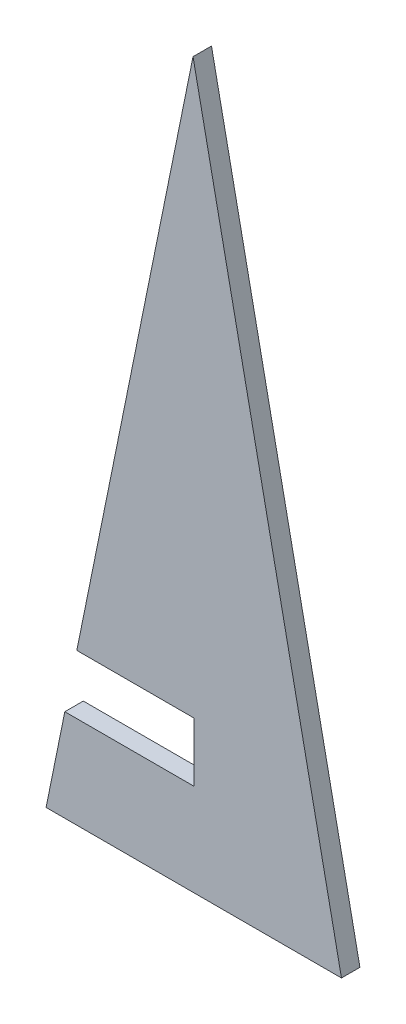
ISO-10303-21;
HEADER;
FILE_DESCRIPTION(('STEP AP214'),'2;1');
FILE_NAME('part.step','',(''),(''),'','','');
FILE_SCHEMA(('AUTOMOTIVE_DESIGN { 1 0 10303 214 1 1 1 1 }'));
ENDSEC;
DATA;
#1=APPLICATION_CONTEXT('core data for automotive mechanical design processes');
#2=APPLICATION_PROTOCOL_DEFINITION('international standard','automotive_design',2000,#1);
#3=PRODUCT_CONTEXT('',#1,'mechanical');
#4=PRODUCT('Part','Part','',(#3));
#5=PRODUCT_RELATED_PRODUCT_CATEGORY('part','',(#4));
#6=PRODUCT_DEFINITION_FORMATION('','',#4);
#7=PRODUCT_DEFINITION_CONTEXT('part definition',#1,'design');
#8=PRODUCT_DEFINITION('design','',#6,#7);
#9=PRODUCT_DEFINITION_SHAPE('','',#8);
#10=(LENGTH_UNIT() NAMED_UNIT(*) SI_UNIT(.MILLI.,.METRE.));
#11=(NAMED_UNIT(*) PLANE_ANGLE_UNIT() SI_UNIT($,.RADIAN.));
#12=(NAMED_UNIT(*) SI_UNIT($,.STERADIAN.) SOLID_ANGLE_UNIT());
#13=UNCERTAINTY_MEASURE_WITH_UNIT(LENGTH_MEASURE(1.E-05),#10,'distance_accuracy_value','');
#14=(GEOMETRIC_REPRESENTATION_CONTEXT(3) GLOBAL_UNCERTAINTY_ASSIGNED_CONTEXT((#13)) GLOBAL_UNIT_ASSIGNED_CONTEXT((#10,
#11,#12)) REPRESENTATION_CONTEXT('',''));
#15=CARTESIAN_POINT('',(0.,0.,0.));
#16=DIRECTION('',(0.,0.,1.));
#17=DIRECTION('',(1.,0.,0.));
#18=AXIS2_PLACEMENT_3D('',#15,#16,#17);
#19=CARTESIAN_POINT('',(0.,0.,-10.));
#20=DIRECTION('',(-0.98,0.198997487421324,0.));
#21=DIRECTION('',(-0.198997487421324,-0.98,0.));
#22=AXIS2_PLACEMENT_3D('',#19,#20,#21);
#23=PLANE('',#22);
#24=DIRECTION('',(0.,0.,-1.));
#25=VECTOR('',#24,1.);
#26=CARTESIAN_POINT('',(10.1529330317002,50.,0.));
#27=LINE('',#26,#25);
#28=CARTESIAN_POINT('',(10.1529330317002,50.,0.));
#29=VERTEX_POINT('',#28);
#30=CARTESIAN_POINT('',(10.1529330317002,50.,-10.));
#31=VERTEX_POINT('',#30);
#32=EDGE_CURVE('E144',#29,#31,#27,.T.);
#33=ORIENTED_EDGE('',*,*,#32,.T.);
#34=DIRECTION('',(-0.198997487421324,-0.98,0.));
#35=VECTOR('',#34,1.);
#36=CARTESIAN_POINT('',(0.,0.,-10.));
#37=LINE('',#36,#35);
#38=CARTESIAN_POINT('',(0.,0.,-10.));
#39=VERTEX_POINT('',#38);
#40=EDGE_CURVE('E65',#31,#39,#37,.T.);
#41=ORIENTED_EDGE('',*,*,#40,.T.);
#42=DIRECTION('',(0.,0.,1.));
#43=VECTOR('',#42,1.);
#44=CARTESIAN_POINT('',(0.,0.,-10.));
#45=LINE('',#44,#43);
#46=CARTESIAN_POINT('',(0.,0.,0.));
#47=VERTEX_POINT('',#46);
#48=EDGE_CURVE('E11',#39,#47,#45,.T.);
#49=ORIENTED_EDGE('',*,*,#48,.T.);
#50=DIRECTION('',(-0.198997487421324,-0.98,0.));
#51=VECTOR('',#50,1.);
#52=CARTESIAN_POINT('',(0.,0.,0.));
#53=LINE('',#52,#51);
#54=EDGE_CURVE('E84',#29,#47,#53,.T.);
#55=ORIENTED_EDGE('',*,*,#54,.F.);
#56=EDGE_LOOP('',(#33,#41,#49,#55));
#57=FACE_BOUND('',#56,.T.);
#58=ADVANCED_FACE('F40',(#57),#23,.T.);
#59=CARTESIAN_POINT('',(160.,0.,-10.));
#60=DIRECTION('',(0.,-1.,0.));
#61=DIRECTION('',(1.,0.,0.));
#62=AXIS2_PLACEMENT_3D('',#59,#60,#61);
#63=PLANE('',#62);
#64=DIRECTION('',(1.,0.,0.));
#65=VECTOR('',#64,1.);
#66=CARTESIAN_POINT('',(160.,0.,0.));
#67=LINE('',#66,#65);
#68=CARTESIAN_POINT('',(160.,0.,0.));
#69=VERTEX_POINT('',#68);
#70=EDGE_CURVE('E143',#47,#69,#67,.T.);
#71=ORIENTED_EDGE('',*,*,#70,.F.);
#72=ORIENTED_EDGE('',*,*,#48,.F.);
#73=DIRECTION('',(1.,0.,0.));
#74=VECTOR('',#73,1.);
#75=CARTESIAN_POINT('',(160.,0.,-10.));
#76=LINE('',#75,#74);
#77=CARTESIAN_POINT('',(160.,0.,-10.));
#78=VERTEX_POINT('',#77);
#79=EDGE_CURVE('E132',#39,#78,#76,.T.);
#80=ORIENTED_EDGE('',*,*,#79,.T.);
#81=DIRECTION('',(0.,0.,1.));
#82=VECTOR('',#81,1.);
#83=CARTESIAN_POINT('',(160.,0.,-10.));
#84=LINE('',#83,#82);
#85=EDGE_CURVE('E44',#78,#69,#84,.T.);
#86=ORIENTED_EDGE('',*,*,#85,.T.);
#87=EDGE_LOOP('',(#71,#72,#80,#86));
#88=FACE_BOUND('',#87,.T.);
#89=ADVANCED_FACE('F42',(#88),#63,.T.);
#90=DIRECTION('',(0.,0.,-1.));
#91=VECTOR('',#90,1.);
#92=CARTESIAN_POINT('',(16.6508101719883,82.,0.));
#93=LINE('',#92,#91);
#94=CARTESIAN_POINT('',(16.6508101719883,82.,0.));
#95=VERTEX_POINT('',#94);
#96=CARTESIAN_POINT('',(16.6508101719883,82.,-10.));
#97=VERTEX_POINT('',#96);
#98=EDGE_CURVE('E114',#95,#97,#93,.T.);
#99=ORIENTED_EDGE('',*,*,#98,.F.);
#100=CARTESIAN_POINT('',(79.5989949685296,392.,0.));
#101=VERTEX_POINT('',#100);
#102=EDGE_CURVE('E124',#101,#95,#53,.T.);
#103=ORIENTED_EDGE('',*,*,#102,.F.);
#104=DIRECTION('',(0.,0.,1.));
#105=VECTOR('',#104,1.);
#106=CARTESIAN_POINT('',(79.5989949685296,392.,-10.));
#107=LINE('',#106,#105);
#108=CARTESIAN_POINT('',(79.5989949685296,392.,-10.));
#109=VERTEX_POINT('',#108);
#110=EDGE_CURVE('E49',#109,#101,#107,.T.);
#111=ORIENTED_EDGE('',*,*,#110,.F.);
#112=EDGE_CURVE('E126',#109,#97,#37,.T.);
#113=ORIENTED_EDGE('',*,*,#112,.T.);
#114=EDGE_LOOP('',(#99,#103,#111,#113));
#115=FACE_BOUND('',#114,.T.);
#116=ADVANCED_FACE('F123',(#115),#23,.T.);
#117=CARTESIAN_POINT('',(79.5989949685296,392.,-10.));
#118=DIRECTION('',(0.979607251294687,0.200921958010737,0.));
#119=DIRECTION('',(-0.200921958010737,0.979607251294687,0.));
#120=AXIS2_PLACEMENT_3D('',#117,#118,#119);
#121=PLANE('',#120);
#122=DIRECTION('',(-0.200921958010737,0.979607251294687,0.));
#123=VECTOR('',#122,1.);
#124=CARTESIAN_POINT('',(79.5989949685296,392.,0.));
#125=LINE('',#124,#123);
#126=EDGE_CURVE('E131',#69,#101,#125,.T.);
#127=ORIENTED_EDGE('',*,*,#126,.F.);
#128=ORIENTED_EDGE('',*,*,#85,.F.);
#129=DIRECTION('',(-0.200921958010737,0.979607251294687,0.));
#130=VECTOR('',#129,1.);
#131=CARTESIAN_POINT('',(79.5989949685296,392.,-10.));
#132=LINE('',#131,#130);
#133=EDGE_CURVE('E135',#78,#109,#132,.T.);
#134=ORIENTED_EDGE('',*,*,#133,.T.);
#135=ORIENTED_EDGE('',*,*,#110,.T.);
#136=EDGE_LOOP('',(#127,#128,#134,#135));
#137=FACE_BOUND('',#136,.T.);
#138=ADVANCED_FACE('F170',(#137),#121,.T.);
#139=CARTESIAN_POINT('',(0.,0.,-10.));
#140=DIRECTION('',(0.,0.,-1.));
#141=DIRECTION('',(-1.,0.,0.));
#142=AXIS2_PLACEMENT_3D('',#139,#140,#141);
#143=PLANE('',#142);
#144=DIRECTION('',(-1.,0.,0.));
#145=VECTOR('',#144,1.);
#146=CARTESIAN_POINT('',(10.1529330317002,50.,-10.));
#147=LINE('',#146,#145);
#148=CARTESIAN_POINT('',(80.1529330317002,50.,-10.));
#149=VERTEX_POINT('',#148);
#150=EDGE_CURVE('E118',#149,#31,#147,.T.);
#151=ORIENTED_EDGE('',*,*,#150,.F.);
#152=DIRECTION('',(0.,-1.,0.));
#153=VECTOR('',#152,1.);
#154=CARTESIAN_POINT('',(80.1529330317002,50.,-10.));
#155=LINE('',#154,#153);
#156=CARTESIAN_POINT('',(80.1529330317002,82.,-10.));
#157=VERTEX_POINT('',#156);
#158=EDGE_CURVE('E154',#157,#149,#155,.T.);
#159=ORIENTED_EDGE('',*,*,#158,.F.);
#160=DIRECTION('',(1.,0.,0.));
#161=VECTOR('',#160,1.);
#162=CARTESIAN_POINT('',(80.1529330317002,82.,-10.));
#163=LINE('',#162,#161);
#164=EDGE_CURVE('E156',#97,#157,#163,.T.);
#165=ORIENTED_EDGE('',*,*,#164,.F.);
#166=ORIENTED_EDGE('',*,*,#112,.F.);
#167=ORIENTED_EDGE('',*,*,#133,.F.);
#168=ORIENTED_EDGE('',*,*,#79,.F.);
#169=ORIENTED_EDGE('',*,*,#40,.F.);
#170=EDGE_LOOP('',(#151,#159,#165,#166,#167,#168,#169));
#171=FACE_BOUND('',#170,.T.);
#172=ADVANCED_FACE('F159',(#171),#143,.T.);
#173=CARTESIAN_POINT('',(0.,0.,0.));
#174=DIRECTION('',(0.,0.,-1.));
#175=DIRECTION('',(-1.,0.,0.));
#176=AXIS2_PLACEMENT_3D('',#173,#174,#175);
#177=PLANE('',#176);
#178=DIRECTION('',(0.,-1.,0.));
#179=VECTOR('',#178,1.);
#180=CARTESIAN_POINT('',(80.1529330317002,50.,0.));
#181=LINE('',#180,#179);
#182=CARTESIAN_POINT('',(80.1529330317002,82.,0.));
#183=VERTEX_POINT('',#182);
#184=CARTESIAN_POINT('',(80.1529330317002,50.,0.));
#185=VERTEX_POINT('',#184);
#186=EDGE_CURVE('E57',#183,#185,#181,.T.);
#187=ORIENTED_EDGE('',*,*,#186,.T.);
#188=DIRECTION('',(-1.,0.,0.));
#189=VECTOR('',#188,1.);
#190=CARTESIAN_POINT('',(10.1529330317002,50.,0.));
#191=LINE('',#190,#189);
#192=EDGE_CURVE('E127',#185,#29,#191,.T.);
#193=ORIENTED_EDGE('',*,*,#192,.T.);
#194=ORIENTED_EDGE('',*,*,#54,.T.);
#195=ORIENTED_EDGE('',*,*,#70,.T.);
#196=ORIENTED_EDGE('',*,*,#126,.T.);
#197=ORIENTED_EDGE('',*,*,#102,.T.);
#198=DIRECTION('',(1.,0.,0.));
#199=VECTOR('',#198,1.);
#200=CARTESIAN_POINT('',(80.1529330317002,82.,0.));
#201=LINE('',#200,#199);
#202=EDGE_CURVE('E110',#95,#183,#201,.T.);
#203=ORIENTED_EDGE('',*,*,#202,.T.);
#204=EDGE_LOOP('',(#187,#193,#194,#195,#196,#197,#203));
#205=FACE_BOUND('',#204,.T.);
#206=ADVANCED_FACE('F130',(#205),#177,.F.);
#207=CARTESIAN_POINT('',(10.1529330317002,50.,0.));
#208=DIRECTION('',(0.,-1.,0.));
#209=DIRECTION('',(1.,0.,0.));
#210=AXIS2_PLACEMENT_3D('',#207,#208,#209);
#211=PLANE('',#210);
#212=ORIENTED_EDGE('',*,*,#150,.T.);
#213=ORIENTED_EDGE('',*,*,#32,.F.);
#214=ORIENTED_EDGE('',*,*,#192,.F.);
#215=DIRECTION('',(0.,0.,-1.));
#216=VECTOR('',#215,1.);
#217=CARTESIAN_POINT('',(80.1529330317002,50.,0.));
#218=LINE('',#217,#216);
#219=EDGE_CURVE('E145',#185,#149,#218,.T.);
#220=ORIENTED_EDGE('',*,*,#219,.T.);
#221=EDGE_LOOP('',(#212,#213,#214,#220));
#222=FACE_BOUND('',#221,.T.);
#223=ADVANCED_FACE('F183',(#222),#211,.F.);
#224=CARTESIAN_POINT('',(80.1529330317002,50.,0.));
#225=DIRECTION('',(1.,0.,0.));
#226=DIRECTION('',(0.,0.,-1.));
#227=AXIS2_PLACEMENT_3D('',#224,#225,#226);
#228=PLANE('',#227);
#229=ORIENTED_EDGE('',*,*,#158,.T.);
#230=ORIENTED_EDGE('',*,*,#219,.F.);
#231=ORIENTED_EDGE('',*,*,#186,.F.);
#232=DIRECTION('',(0.,0.,-1.));
#233=VECTOR('',#232,1.);
#234=CARTESIAN_POINT('',(80.1529330317002,82.,0.));
#235=LINE('',#234,#233);
#236=EDGE_CURVE('E116',#183,#157,#235,.T.);
#237=ORIENTED_EDGE('',*,*,#236,.T.);
#238=EDGE_LOOP('',(#229,#230,#231,#237));
#239=FACE_BOUND('',#238,.T.);
#240=ADVANCED_FACE('F152',(#239),#228,.F.);
#241=CARTESIAN_POINT('',(80.1529330317002,82.,0.));
#242=DIRECTION('',(0.,1.,0.));
#243=DIRECTION('',(-1.,0.,0.));
#244=AXIS2_PLACEMENT_3D('',#241,#242,#243);
#245=PLANE('',#244);
#246=ORIENTED_EDGE('',*,*,#164,.T.);
#247=ORIENTED_EDGE('',*,*,#236,.F.);
#248=ORIENTED_EDGE('',*,*,#202,.F.);
#249=ORIENTED_EDGE('',*,*,#98,.T.);
#250=EDGE_LOOP('',(#246,#247,#248,#249));
#251=FACE_BOUND('',#250,.T.);
#252=ADVANCED_FACE('F113',(#251),#245,.F.);
#253=CLOSED_SHELL('',(#58,#89,#116,#138,#172,#206,#223,#240,#252));
#254=MANIFOLD_SOLID_BREP('B2',#253);
#255=ADVANCED_BREP_SHAPE_REPRESENTATION('',(#18,#254),#14);
#256=SHAPE_DEFINITION_REPRESENTATION(#9,#255);
ENDSEC;
END-ISO-10303-21;
